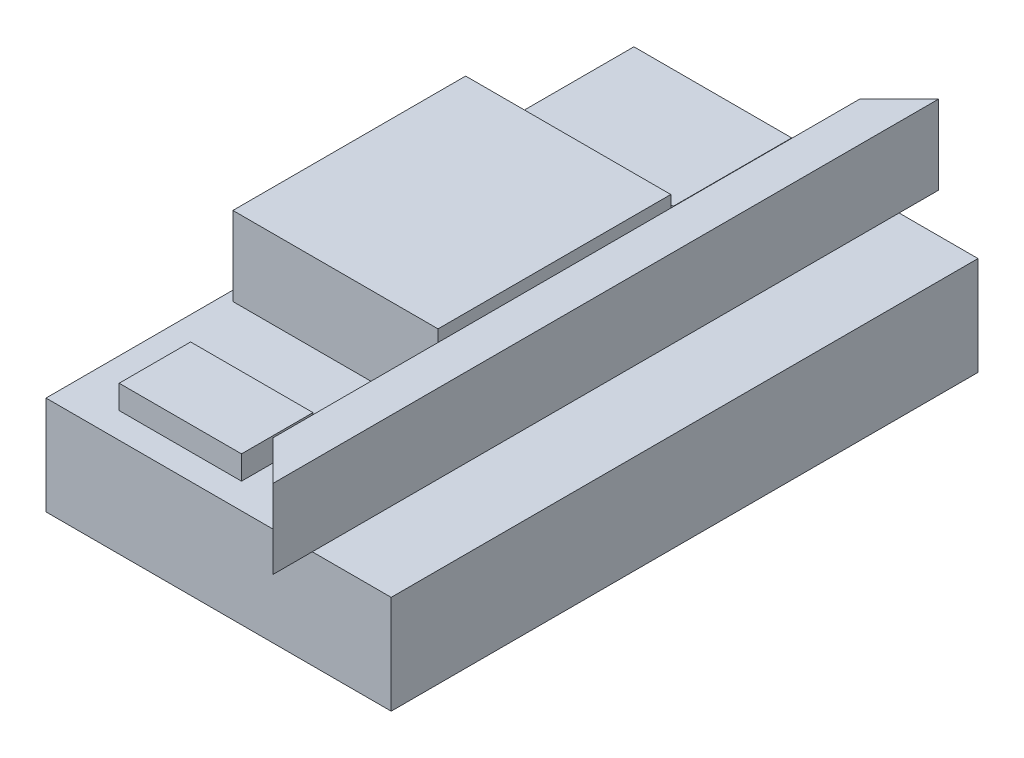
ISO-10303-21;
HEADER;
FILE_DESCRIPTION(('STEP AP214'),'2;1');
FILE_NAME('part.step','',(''),(''),'','','');
FILE_SCHEMA(('AUTOMOTIVE_DESIGN { 1 0 10303 214 1 1 1 1 }'));
ENDSEC;
DATA;
#1=APPLICATION_CONTEXT('core data for automotive mechanical design processes');
#2=APPLICATION_PROTOCOL_DEFINITION('international standard','automotive_design',2000,#1);
#3=PRODUCT_CONTEXT('',#1,'mechanical');
#4=PRODUCT('Part','Part','',(#3));
#5=PRODUCT_RELATED_PRODUCT_CATEGORY('part','',(#4));
#6=PRODUCT_DEFINITION_FORMATION('','',#4);
#7=PRODUCT_DEFINITION_CONTEXT('part definition',#1,'design');
#8=PRODUCT_DEFINITION('design','',#6,#7);
#9=PRODUCT_DEFINITION_SHAPE('','',#8);
#10=(LENGTH_UNIT() NAMED_UNIT(*) SI_UNIT(.MILLI.,.METRE.));
#11=(NAMED_UNIT(*) PLANE_ANGLE_UNIT() SI_UNIT($,.RADIAN.));
#12=(NAMED_UNIT(*) SI_UNIT($,.STERADIAN.) SOLID_ANGLE_UNIT());
#13=UNCERTAINTY_MEASURE_WITH_UNIT(LENGTH_MEASURE(1.E-05),#10,'distance_accuracy_value','');
#14=(GEOMETRIC_REPRESENTATION_CONTEXT(3) GLOBAL_UNCERTAINTY_ASSIGNED_CONTEXT((#13)) GLOBAL_UNIT_ASSIGNED_CONTEXT((#10,
#11,#12)) REPRESENTATION_CONTEXT('',''));
#15=CARTESIAN_POINT('',(0.,0.,0.));
#16=DIRECTION('',(0.,0.,1.));
#17=DIRECTION('',(1.,0.,0.));
#18=AXIS2_PLACEMENT_3D('',#15,#16,#17);
#19=CARTESIAN_POINT('',(0.,63.5,377.825));
#20=DIRECTION('',(0.,-1.,0.));
#21=DIRECTION('',(0.,0.,-1.));
#22=AXIS2_PLACEMENT_3D('',#19,#20,#21);
#23=PLANE('',#22);
#24=DIRECTION('',(0.,0.,-1.));
#25=VECTOR('',#24,1.);
#26=CARTESIAN_POINT('',(120.406671705079,63.5,94.2971975285047));
#27=LINE('',#26,#25);
#28=CARTESIAN_POINT('',(120.406671705079,63.5,94.2971975285047));
#29=VERTEX_POINT('',#28);
#30=CARTESIAN_POINT('',(120.406671705079,63.5,18.0971975285047));
#31=VERTEX_POINT('',#30);
#32=EDGE_CURVE('E305',#29,#31,#27,.T.);
#33=ORIENTED_EDGE('',*,*,#32,.F.);
#34=DIRECTION('',(1.,0.,0.));
#35=VECTOR('',#34,1.);
#36=CARTESIAN_POINT('',(120.406671705079,63.5,94.2971975285047));
#37=LINE('',#36,#35);
#38=CARTESIAN_POINT('',(18.8066717050788,63.5,94.2971975285047));
#39=VERTEX_POINT('',#38);
#40=EDGE_CURVE('E295',#39,#29,#37,.T.);
#41=ORIENTED_EDGE('',*,*,#40,.F.);
#42=DIRECTION('',(0.,0.,1.));
#43=VECTOR('',#42,1.);
#44=CARTESIAN_POINT('',(18.8066717050788,63.5,94.2971975285048));
#45=LINE('',#44,#43);
#46=CARTESIAN_POINT('',(18.8066717050788,63.5,18.0971975285048));
#47=VERTEX_POINT('',#46);
#48=EDGE_CURVE('E299',#47,#39,#45,.T.);
#49=ORIENTED_EDGE('',*,*,#48,.F.);
#50=DIRECTION('',(-1.,0.,0.));
#51=VECTOR('',#50,1.);
#52=CARTESIAN_POINT('',(120.406671705079,63.5,18.0971975285047));
#53=LINE('',#52,#51);
#54=EDGE_CURVE('E302',#31,#47,#53,.T.);
#55=ORIENTED_EDGE('',*,*,#54,.F.);
#56=EDGE_LOOP('',(#33,#41,#49,#55));
#57=FACE_BOUND('',#56,.T.);
#58=DIRECTION('',(0.,0.,1.));
#59=VECTOR('',#58,1.);
#60=CARTESIAN_POINT('',(146.05,63.5,403.225));
#61=LINE('',#60,#59);
#62=CARTESIAN_POINT('',(146.05,63.5,0.));
#63=VERTEX_POINT('',#62);
#64=CARTESIAN_POINT('',(146.05,63.5,377.825));
#65=VERTEX_POINT('',#64);
#66=EDGE_CURVE('E239',#63,#65,#61,.T.);
#67=ORIENTED_EDGE('',*,*,#66,.F.);
#68=DIRECTION('',(-1.,0.,0.));
#69=VECTOR('',#68,1.);
#70=CARTESIAN_POINT('',(0.,63.5,0.));
#71=LINE('',#70,#69);
#72=CARTESIAN_POINT('',(0.,63.5,0.));
#73=VERTEX_POINT('',#72);
#74=EDGE_CURVE('E226',#63,#73,#71,.T.);
#75=ORIENTED_EDGE('',*,*,#74,.T.);
#76=DIRECTION('',(0.,0.,-1.));
#77=VECTOR('',#76,1.);
#78=CARTESIAN_POINT('',(0.,63.5,377.825));
#79=LINE('',#78,#77);
#80=CARTESIAN_POINT('',(0.,63.5,377.825));
#81=VERTEX_POINT('',#80);
#82=EDGE_CURVE('E220',#81,#73,#79,.T.);
#83=ORIENTED_EDGE('',*,*,#82,.F.);
#84=DIRECTION('',(-1.,0.,0.));
#85=VECTOR('',#84,1.);
#86=CARTESIAN_POINT('',(0.,63.5,377.825));
#87=LINE('',#86,#85);
#88=EDGE_CURVE('E217',#65,#81,#87,.T.);
#89=ORIENTED_EDGE('',*,*,#88,.F.);
#90=EDGE_LOOP('',(#67,#75,#83,#89));
#91=FACE_BOUND('',#90,.T.);
#92=DIRECTION('',(0.,0.,-1.));
#93=VECTOR('',#92,1.);
#94=CARTESIAN_POINT('',(138.43,63.5,113.9825));
#95=LINE('',#94,#93);
#96=CARTESIAN_POINT('',(138.43,63.5,263.8425));
#97=VERTEX_POINT('',#96);
#98=CARTESIAN_POINT('',(138.43,63.5,113.9825));
#99=VERTEX_POINT('',#98);
#100=EDGE_CURVE('E272',#97,#99,#95,.T.);
#101=ORIENTED_EDGE('',*,*,#100,.F.);
#102=DIRECTION('',(1.,0.,0.));
#103=VECTOR('',#102,1.);
#104=CARTESIAN_POINT('',(138.43,63.5,263.8425));
#105=LINE('',#104,#103);
#106=CARTESIAN_POINT('',(6.34999999999995,63.5,263.8425));
#107=VERTEX_POINT('',#106);
#108=EDGE_CURVE('E262',#107,#97,#105,.T.);
#109=ORIENTED_EDGE('',*,*,#108,.F.);
#110=DIRECTION('',(0.,0.,1.));
#111=VECTOR('',#110,1.);
#112=CARTESIAN_POINT('',(6.34999999999995,63.5,113.9825));
#113=LINE('',#112,#111);
#114=CARTESIAN_POINT('',(6.34999999999995,63.5,113.9825));
#115=VERTEX_POINT('',#114);
#116=EDGE_CURVE('E266',#115,#107,#113,.T.);
#117=ORIENTED_EDGE('',*,*,#116,.F.);
#118=DIRECTION('',(-1.,0.,0.));
#119=VECTOR('',#118,1.);
#120=CARTESIAN_POINT('',(138.43,63.5,113.9825));
#121=LINE('',#120,#119);
#122=EDGE_CURVE('E269',#99,#115,#121,.T.);
#123=ORIENTED_EDGE('',*,*,#122,.F.);
#124=EDGE_LOOP('',(#101,#109,#117,#123));
#125=FACE_BOUND('',#124,.T.);
#126=DIRECTION('',(0.,0.,-1.));
#127=VECTOR('',#126,1.);
#128=CARTESIAN_POINT('',(109.303255926818,63.5,361.249309245466));
#129=LINE('',#128,#127);
#130=CARTESIAN_POINT('',(109.303255926818,63.5,361.249309245466));
#131=VERTEX_POINT('',#130);
#132=CARTESIAN_POINT('',(109.303255926818,63.5,315.233608424478));
#133=VERTEX_POINT('',#132);
#134=EDGE_CURVE('E335',#131,#133,#129,.T.);
#135=ORIENTED_EDGE('',*,*,#134,.F.);
#136=DIRECTION('',(1.,0.,0.));
#137=VECTOR('',#136,1.);
#138=CARTESIAN_POINT('',(109.303255926818,63.5,361.249309245466));
#139=LINE('',#138,#137);
#140=CARTESIAN_POINT('',(30.5246059731417,63.5,361.249309245466));
#141=VERTEX_POINT('',#140);
#142=EDGE_CURVE('E327',#141,#131,#139,.T.);
#143=ORIENTED_EDGE('',*,*,#142,.F.);
#144=DIRECTION('',(0.,0.,1.));
#145=VECTOR('',#144,1.);
#146=CARTESIAN_POINT('',(30.5246059731417,63.5,361.249309245466));
#147=LINE('',#146,#145);
#148=CARTESIAN_POINT('',(30.5246059731417,63.5,315.233608424478));
#149=VERTEX_POINT('',#148);
#150=EDGE_CURVE('E331',#149,#141,#147,.T.);
#151=ORIENTED_EDGE('',*,*,#150,.F.);
#152=DIRECTION('',(-1.,0.,0.));
#153=VECTOR('',#152,1.);
#154=CARTESIAN_POINT('',(109.303255926818,63.5,315.233608424478));
#155=LINE('',#154,#153);
#156=EDGE_CURVE('E56',#133,#149,#155,.T.);
#157=ORIENTED_EDGE('',*,*,#156,.F.);
#158=EDGE_LOOP('',(#135,#143,#151,#157));
#159=FACE_BOUND('',#158,.T.);
#160=ADVANCED_FACE('F33',(#57,#91,#125,#159),#23,.F.);
#161=DIRECTION('',(0.,0.,-1.));
#162=VECTOR('',#161,1.);
#163=CARTESIAN_POINT('',(171.45,63.5,403.225));
#164=LINE('',#163,#162);
#165=CARTESIAN_POINT('',(171.45,63.5,377.825));
#166=VERTEX_POINT('',#165);
#167=CARTESIAN_POINT('',(171.45,63.5,0.));
#168=VERTEX_POINT('',#167);
#169=EDGE_CURVE('E41',#166,#168,#164,.T.);
#170=ORIENTED_EDGE('',*,*,#169,.F.);
#171=CARTESIAN_POINT('',(222.25,63.5,377.825));
#172=VERTEX_POINT('',#171);
#173=EDGE_CURVE('E218',#172,#166,#87,.T.);
#174=ORIENTED_EDGE('',*,*,#173,.F.);
#175=DIRECTION('',(0.,0.,-1.));
#176=VECTOR('',#175,1.);
#177=CARTESIAN_POINT('',(222.25,63.5,377.825));
#178=LINE('',#177,#176);
#179=CARTESIAN_POINT('',(222.25,63.5,0.));
#180=VERTEX_POINT('',#179);
#181=EDGE_CURVE('E232',#172,#180,#178,.T.);
#182=ORIENTED_EDGE('',*,*,#181,.T.);
#183=EDGE_CURVE('E213',#180,#168,#71,.T.);
#184=ORIENTED_EDGE('',*,*,#183,.T.);
#185=EDGE_LOOP('',(#170,#174,#182,#184));
#186=FACE_BOUND('',#185,.T.);
#187=ADVANCED_FACE('F367',(#186),#23,.F.);
#188=CARTESIAN_POINT('',(0.,0.,377.825));
#189=DIRECTION('',(1.,0.,0.));
#190=DIRECTION('',(0.,0.,-1.));
#191=AXIS2_PLACEMENT_3D('',#188,#189,#190);
#192=PLANE('',#191);
#193=DIRECTION('',(0.,-1.,0.));
#194=VECTOR('',#193,1.);
#195=CARTESIAN_POINT('',(0.,0.,0.));
#196=LINE('',#195,#194);
#197=CARTESIAN_POINT('',(0.,0.,0.));
#198=VERTEX_POINT('',#197);
#199=EDGE_CURVE('E200',#73,#198,#196,.T.);
#200=ORIENTED_EDGE('',*,*,#199,.T.);
#201=DIRECTION('',(0.,0.,-1.));
#202=VECTOR('',#201,1.);
#203=CARTESIAN_POINT('',(0.,0.,377.825));
#204=LINE('',#203,#202);
#205=CARTESIAN_POINT('',(0.,0.,377.825));
#206=VERTEX_POINT('',#205);
#207=EDGE_CURVE('E237',#206,#198,#204,.T.);
#208=ORIENTED_EDGE('',*,*,#207,.F.);
#209=DIRECTION('',(0.,-1.,0.));
#210=VECTOR('',#209,1.);
#211=CARTESIAN_POINT('',(0.,0.,377.825));
#212=LINE('',#211,#210);
#213=EDGE_CURVE('E209',#81,#206,#212,.T.);
#214=ORIENTED_EDGE('',*,*,#213,.F.);
#215=ORIENTED_EDGE('',*,*,#82,.T.);
#216=EDGE_LOOP('',(#200,#208,#214,#215));
#217=FACE_BOUND('',#216,.T.);
#218=ADVANCED_FACE('F35',(#217),#192,.F.);
#219=CARTESIAN_POINT('',(0.,0.,377.825));
#220=DIRECTION('',(0.,1.,0.));
#221=DIRECTION('',(0.,0.,1.));
#222=AXIS2_PLACEMENT_3D('',#219,#220,#221);
#223=PLANE('',#222);
#224=DIRECTION('',(1.,0.,0.));
#225=VECTOR('',#224,1.);
#226=CARTESIAN_POINT('',(0.,0.,0.));
#227=LINE('',#226,#225);
#228=CARTESIAN_POINT('',(222.25,0.,0.));
#229=VERTEX_POINT('',#228);
#230=EDGE_CURVE('E204',#198,#229,#227,.T.);
#231=ORIENTED_EDGE('',*,*,#230,.T.);
#232=DIRECTION('',(0.,0.,-1.));
#233=VECTOR('',#232,1.);
#234=CARTESIAN_POINT('',(222.25,0.,377.825));
#235=LINE('',#234,#233);
#236=CARTESIAN_POINT('',(222.25,0.,377.825));
#237=VERTEX_POINT('',#236);
#238=EDGE_CURVE('E235',#237,#229,#235,.T.);
#239=ORIENTED_EDGE('',*,*,#238,.F.);
#240=DIRECTION('',(1.,0.,0.));
#241=VECTOR('',#240,1.);
#242=CARTESIAN_POINT('',(0.,0.,377.825));
#243=LINE('',#242,#241);
#244=EDGE_CURVE('E212',#206,#237,#243,.T.);
#245=ORIENTED_EDGE('',*,*,#244,.F.);
#246=ORIENTED_EDGE('',*,*,#207,.T.);
#247=EDGE_LOOP('',(#231,#239,#245,#246));
#248=FACE_BOUND('',#247,.T.);
#249=ADVANCED_FACE('F379',(#248),#223,.F.);
#250=CARTESIAN_POINT('',(222.25,0.,377.825));
#251=DIRECTION('',(-1.,0.,0.));
#252=DIRECTION('',(0.,0.,1.));
#253=AXIS2_PLACEMENT_3D('',#250,#251,#252);
#254=PLANE('',#253);
#255=DIRECTION('',(0.,1.,0.));
#256=VECTOR('',#255,1.);
#257=CARTESIAN_POINT('',(222.25,0.,0.));
#258=LINE('',#257,#256);
#259=EDGE_CURVE('E224',#229,#180,#258,.T.);
#260=ORIENTED_EDGE('',*,*,#259,.T.);
#261=ORIENTED_EDGE('',*,*,#181,.F.);
#262=DIRECTION('',(0.,1.,0.));
#263=VECTOR('',#262,1.);
#264=CARTESIAN_POINT('',(222.25,0.,377.825));
#265=LINE('',#264,#263);
#266=EDGE_CURVE('E215',#237,#172,#265,.T.);
#267=ORIENTED_EDGE('',*,*,#266,.F.);
#268=ORIENTED_EDGE('',*,*,#238,.T.);
#269=EDGE_LOOP('',(#260,#261,#267,#268));
#270=FACE_BOUND('',#269,.T.);
#271=ADVANCED_FACE('F385',(#270),#254,.F.);
#272=CARTESIAN_POINT('',(0.,0.,377.825));
#273=DIRECTION('',(0.,0.,-1.));
#274=DIRECTION('',(-1.,0.,0.));
#275=AXIS2_PLACEMENT_3D('',#272,#273,#274);
#276=PLANE('',#275);
#277=EDGE_CURVE('E221',#166,#65,#87,.T.);
#278=ORIENTED_EDGE('',*,*,#277,.T.);
#279=ORIENTED_EDGE('',*,*,#88,.T.);
#280=ORIENTED_EDGE('',*,*,#213,.T.);
#281=ORIENTED_EDGE('',*,*,#244,.T.);
#282=ORIENTED_EDGE('',*,*,#266,.T.);
#283=ORIENTED_EDGE('',*,*,#173,.T.);
#284=EDGE_LOOP('',(#278,#279,#280,#281,#282,#283));
#285=FACE_BOUND('',#284,.T.);
#286=ADVANCED_FACE('F371',(#285),#276,.F.);
#287=CARTESIAN_POINT('',(0.,0.,0.));
#288=DIRECTION('',(0.,0.,-1.));
#289=DIRECTION('',(-1.,0.,0.));
#290=AXIS2_PLACEMENT_3D('',#287,#288,#289);
#291=PLANE('',#290);
#292=ORIENTED_EDGE('',*,*,#74,.F.);
#293=EDGE_CURVE('E229',#168,#63,#71,.T.);
#294=ORIENTED_EDGE('',*,*,#293,.F.);
#295=ORIENTED_EDGE('',*,*,#183,.F.);
#296=ORIENTED_EDGE('',*,*,#259,.F.);
#297=ORIENTED_EDGE('',*,*,#230,.F.);
#298=ORIENTED_EDGE('',*,*,#199,.F.);
#299=EDGE_LOOP('',(#292,#294,#295,#296,#297,#298));
#300=FACE_BOUND('',#299,.T.);
#301=ADVANCED_FACE('F360',(#300),#291,.T.);
#302=CARTESIAN_POINT('',(0.,63.5,0.));
#303=DIRECTION('',(0.,1.,0.));
#304=DIRECTION('',(0.,0.,1.));
#305=AXIS2_PLACEMENT_3D('',#302,#303,#304);
#306=PLANE('',#305);
#307=ORIENTED_EDGE('',*,*,#293,.T.);
#308=DIRECTION('',(0.707106781186548,0.,-0.707106781186547));
#309=VECTOR('',#308,1.);
#310=CARTESIAN_POINT('',(73.025,63.5,73.025));
#311=LINE('',#310,#309);
#312=CARTESIAN_POINT('',(171.45,63.5,-25.4));
#313=VERTEX_POINT('',#312);
#314=EDGE_CURVE('E338',#63,#313,#311,.T.);
#315=ORIENTED_EDGE('',*,*,#314,.T.);
#316=EDGE_CURVE('E199',#168,#313,#164,.T.);
#317=ORIENTED_EDGE('',*,*,#316,.F.);
#318=EDGE_LOOP('',(#307,#315,#317));
#319=FACE_BOUND('',#318,.T.);
#320=ADVANCED_FACE('F363',(#319),#306,.F.);
#321=CARTESIAN_POINT('',(171.45,114.3,403.225));
#322=DIRECTION('',(-1.,0.,0.));
#323=DIRECTION('',(0.,0.,1.));
#324=AXIS2_PLACEMENT_3D('',#321,#322,#323);
#325=PLANE('',#324);
#326=CARTESIAN_POINT('',(171.45,63.5,403.225));
#327=VERTEX_POINT('',#326);
#328=EDGE_CURVE('E192',#327,#166,#164,.T.);
#329=ORIENTED_EDGE('',*,*,#328,.T.);
#330=ORIENTED_EDGE('',*,*,#169,.T.);
#331=ORIENTED_EDGE('',*,*,#316,.T.);
#332=DIRECTION('',(0.,-1.,0.));
#333=VECTOR('',#332,1.);
#334=CARTESIAN_POINT('',(171.45,114.3,-25.4));
#335=LINE('',#334,#333);
#336=CARTESIAN_POINT('',(171.45,114.3,-25.4));
#337=VERTEX_POINT('',#336);
#338=EDGE_CURVE('E177',#337,#313,#335,.T.);
#339=ORIENTED_EDGE('',*,*,#338,.F.);
#340=DIRECTION('',(0.,0.,-1.));
#341=VECTOR('',#340,1.);
#342=CARTESIAN_POINT('',(171.45,114.3,403.225));
#343=LINE('',#342,#341);
#344=CARTESIAN_POINT('',(171.45,114.3,403.225));
#345=VERTEX_POINT('',#344);
#346=EDGE_CURVE('E186',#345,#337,#343,.T.);
#347=ORIENTED_EDGE('',*,*,#346,.F.);
#348=DIRECTION('',(0.,-1.,0.));
#349=VECTOR('',#348,1.);
#350=CARTESIAN_POINT('',(171.45,114.3,403.225));
#351=LINE('',#350,#349);
#352=EDGE_CURVE('E201',#345,#327,#351,.T.);
#353=ORIENTED_EDGE('',*,*,#352,.T.);
#354=EDGE_LOOP('',(#329,#330,#331,#339,#347,#353));
#355=FACE_BOUND('',#354,.T.);
#356=ADVANCED_FACE('F196',(#355),#325,.F.);
#357=CARTESIAN_POINT('',(146.05,114.3,403.225));
#358=DIRECTION('',(1.,0.,0.));
#359=DIRECTION('',(0.,0.,-1.));
#360=AXIS2_PLACEMENT_3D('',#357,#358,#359);
#361=PLANE('',#360);
#362=DIRECTION('',(0.,0.,1.));
#363=VECTOR('',#362,1.);
#364=CARTESIAN_POINT('',(146.05,114.3,403.225));
#365=LINE('',#364,#363);
#366=CARTESIAN_POINT('',(146.05,114.3,0.));
#367=VERTEX_POINT('',#366);
#368=CARTESIAN_POINT('',(146.05,114.3,377.825));
#369=VERTEX_POINT('',#368);
#370=EDGE_CURVE('E191',#367,#369,#365,.T.);
#371=ORIENTED_EDGE('',*,*,#370,.F.);
#372=DIRECTION('',(0.,1.,0.));
#373=VECTOR('',#372,1.);
#374=CARTESIAN_POINT('',(146.05,-12.7,0.));
#375=LINE('',#374,#373);
#376=EDGE_CURVE('E48',#63,#367,#375,.T.);
#377=ORIENTED_EDGE('',*,*,#376,.F.);
#378=ORIENTED_EDGE('',*,*,#66,.T.);
#379=DIRECTION('',(0.,1.,0.));
#380=VECTOR('',#379,1.);
#381=CARTESIAN_POINT('',(146.05,-12.7,377.825));
#382=LINE('',#381,#380);
#383=EDGE_CURVE('E182',#65,#369,#382,.T.);
#384=ORIENTED_EDGE('',*,*,#383,.T.);
#385=EDGE_LOOP('',(#371,#377,#378,#384));
#386=FACE_BOUND('',#385,.T.);
#387=ADVANCED_FACE('F351',(#386),#361,.F.);
#388=CARTESIAN_POINT('',(0.,114.3,0.));
#389=DIRECTION('',(0.,1.,0.));
#390=DIRECTION('',(0.,0.,1.));
#391=AXIS2_PLACEMENT_3D('',#388,#389,#390);
#392=PLANE('',#391);
#393=DIRECTION('',(0.707106781186548,0.,-0.707106781186547));
#394=VECTOR('',#393,1.);
#395=CARTESIAN_POINT('',(171.45,114.3,-25.4));
#396=LINE('',#395,#394);
#397=EDGE_CURVE('E173',#367,#337,#396,.T.);
#398=ORIENTED_EDGE('',*,*,#397,.F.);
#399=ORIENTED_EDGE('',*,*,#370,.T.);
#400=DIRECTION('',(-0.707106781186548,0.,-0.707106781186547));
#401=VECTOR('',#400,1.);
#402=CARTESIAN_POINT('',(171.45,114.3,403.225));
#403=LINE('',#402,#401);
#404=EDGE_CURVE('E188',#345,#369,#403,.T.);
#405=ORIENTED_EDGE('',*,*,#404,.F.);
#406=ORIENTED_EDGE('',*,*,#346,.T.);
#407=EDGE_LOOP('',(#398,#399,#405,#406));
#408=FACE_BOUND('',#407,.T.);
#409=ADVANCED_FACE('F187',(#408),#392,.T.);
#410=ORIENTED_EDGE('',*,*,#328,.F.);
#411=DIRECTION('',(-0.707106781186548,0.,-0.707106781186547));
#412=VECTOR('',#411,1.);
#413=CARTESIAN_POINT('',(-115.8875,63.5,115.8875));
#414=LINE('',#413,#412);
#415=EDGE_CURVE('E11',#327,#65,#414,.T.);
#416=ORIENTED_EDGE('',*,*,#415,.T.);
#417=ORIENTED_EDGE('',*,*,#277,.F.);
#418=EDGE_LOOP('',(#410,#416,#417));
#419=FACE_BOUND('',#418,.T.);
#420=ADVANCED_FACE('F375',(#419),#306,.F.);
#421=CARTESIAN_POINT('',(138.43,114.3,113.9825));
#422=DIRECTION('',(-1.,0.,0.));
#423=DIRECTION('',(0.,0.,1.));
#424=AXIS2_PLACEMENT_3D('',#421,#422,#423);
#425=PLANE('',#424);
#426=ORIENTED_EDGE('',*,*,#100,.T.);
#427=DIRECTION('',(0.,-1.,0.));
#428=VECTOR('',#427,1.);
#429=CARTESIAN_POINT('',(138.43,114.3,113.9825));
#430=LINE('',#429,#428);
#431=CARTESIAN_POINT('',(138.43,114.3,113.9825));
#432=VERTEX_POINT('',#431);
#433=EDGE_CURVE('E249',#432,#99,#430,.T.);
#434=ORIENTED_EDGE('',*,*,#433,.F.);
#435=DIRECTION('',(0.,0.,-1.));
#436=VECTOR('',#435,1.);
#437=CARTESIAN_POINT('',(138.43,114.3,113.9825));
#438=LINE('',#437,#436);
#439=CARTESIAN_POINT('',(138.43,114.3,263.8425));
#440=VERTEX_POINT('',#439);
#441=EDGE_CURVE('E265',#440,#432,#438,.T.);
#442=ORIENTED_EDGE('',*,*,#441,.F.);
#443=DIRECTION('',(0.,-1.,0.));
#444=VECTOR('',#443,1.);
#445=CARTESIAN_POINT('',(138.43,114.3,263.8425));
#446=LINE('',#445,#444);
#447=EDGE_CURVE('E258',#440,#97,#446,.T.);
#448=ORIENTED_EDGE('',*,*,#447,.T.);
#449=EDGE_LOOP('',(#426,#434,#442,#448));
#450=FACE_BOUND('',#449,.T.);
#451=ADVANCED_FACE('F412',(#450),#425,.F.);
#452=CARTESIAN_POINT('',(138.43,114.3,113.9825));
#453=DIRECTION('',(0.,0.,1.));
#454=DIRECTION('',(1.,0.,0.));
#455=AXIS2_PLACEMENT_3D('',#452,#453,#454);
#456=PLANE('',#455);
#457=ORIENTED_EDGE('',*,*,#122,.T.);
#458=DIRECTION('',(0.,-1.,0.));
#459=VECTOR('',#458,1.);
#460=CARTESIAN_POINT('',(6.34999999999995,114.3,113.9825));
#461=LINE('',#460,#459);
#462=CARTESIAN_POINT('',(6.34999999999995,114.3,113.9825));
#463=VERTEX_POINT('',#462);
#464=EDGE_CURVE('E252',#463,#115,#461,.T.);
#465=ORIENTED_EDGE('',*,*,#464,.F.);
#466=DIRECTION('',(-1.,0.,0.));
#467=VECTOR('',#466,1.);
#468=CARTESIAN_POINT('',(138.43,114.3,113.9825));
#469=LINE('',#468,#467);
#470=EDGE_CURVE('E279',#432,#463,#469,.T.);
#471=ORIENTED_EDGE('',*,*,#470,.F.);
#472=ORIENTED_EDGE('',*,*,#433,.T.);
#473=EDGE_LOOP('',(#457,#465,#471,#472));
#474=FACE_BOUND('',#473,.T.);
#475=ADVANCED_FACE('F417',(#474),#456,.F.);
#476=CARTESIAN_POINT('',(6.34999999999995,114.3,113.9825));
#477=DIRECTION('',(1.,0.,0.));
#478=DIRECTION('',(0.,0.,-1.));
#479=AXIS2_PLACEMENT_3D('',#476,#477,#478);
#480=PLANE('',#479);
#481=ORIENTED_EDGE('',*,*,#116,.T.);
#482=DIRECTION('',(0.,-1.,0.));
#483=VECTOR('',#482,1.);
#484=CARTESIAN_POINT('',(6.34999999999995,114.3,263.8425));
#485=LINE('',#484,#483);
#486=CARTESIAN_POINT('',(6.34999999999995,114.3,263.8425));
#487=VERTEX_POINT('',#486);
#488=EDGE_CURVE('E255',#487,#107,#485,.T.);
#489=ORIENTED_EDGE('',*,*,#488,.F.);
#490=DIRECTION('',(0.,0.,1.));
#491=VECTOR('',#490,1.);
#492=CARTESIAN_POINT('',(6.34999999999995,114.3,113.9825));
#493=LINE('',#492,#491);
#494=EDGE_CURVE('E277',#463,#487,#493,.T.);
#495=ORIENTED_EDGE('',*,*,#494,.F.);
#496=ORIENTED_EDGE('',*,*,#464,.T.);
#497=EDGE_LOOP('',(#481,#489,#495,#496));
#498=FACE_BOUND('',#497,.T.);
#499=ADVANCED_FACE('F421',(#498),#480,.F.);
#500=CARTESIAN_POINT('',(138.43,114.3,263.8425));
#501=DIRECTION('',(0.,0.,-1.));
#502=DIRECTION('',(-1.,0.,0.));
#503=AXIS2_PLACEMENT_3D('',#500,#501,#502);
#504=PLANE('',#503);
#505=ORIENTED_EDGE('',*,*,#108,.T.);
#506=ORIENTED_EDGE('',*,*,#447,.F.);
#507=DIRECTION('',(1.,0.,0.));
#508=VECTOR('',#507,1.);
#509=CARTESIAN_POINT('',(138.43,114.3,263.8425));
#510=LINE('',#509,#508);
#511=EDGE_CURVE('E261',#487,#440,#510,.T.);
#512=ORIENTED_EDGE('',*,*,#511,.F.);
#513=ORIENTED_EDGE('',*,*,#488,.T.);
#514=EDGE_LOOP('',(#505,#506,#512,#513));
#515=FACE_BOUND('',#514,.T.);
#516=ADVANCED_FACE('F425',(#515),#504,.F.);
#517=CARTESIAN_POINT('',(0.,114.3,0.));
#518=DIRECTION('',(0.,-1.,0.));
#519=DIRECTION('',(0.,0.,-1.));
#520=AXIS2_PLACEMENT_3D('',#517,#518,#519);
#521=PLANE('',#520);
#522=ORIENTED_EDGE('',*,*,#441,.T.);
#523=ORIENTED_EDGE('',*,*,#470,.T.);
#524=ORIENTED_EDGE('',*,*,#494,.T.);
#525=ORIENTED_EDGE('',*,*,#511,.T.);
#526=EDGE_LOOP('',(#522,#523,#524,#525));
#527=FACE_BOUND('',#526,.T.);
#528=ADVANCED_FACE('F429',(#527),#521,.F.);
#529=CARTESIAN_POINT('',(120.406671705079,88.9,94.2971975285047));
#530=DIRECTION('',(-1.,0.,0.));
#531=DIRECTION('',(0.,0.,1.));
#532=AXIS2_PLACEMENT_3D('',#529,#530,#531);
#533=PLANE('',#532);
#534=ORIENTED_EDGE('',*,*,#32,.T.);
#535=DIRECTION('',(0.,-1.,0.));
#536=VECTOR('',#535,1.);
#537=CARTESIAN_POINT('',(120.406671705079,88.9,18.0971975285047));
#538=LINE('',#537,#536);
#539=CARTESIAN_POINT('',(120.406671705079,88.9,18.0971975285047));
#540=VERTEX_POINT('',#539);
#541=EDGE_CURVE('E275',#540,#31,#538,.T.);
#542=ORIENTED_EDGE('',*,*,#541,.F.);
#543=DIRECTION('',(0.,0.,-1.));
#544=VECTOR('',#543,1.);
#545=CARTESIAN_POINT('',(120.406671705079,88.9,94.2971975285047));
#546=LINE('',#545,#544);
#547=CARTESIAN_POINT('',(120.406671705079,88.9,94.2971975285047));
#548=VERTEX_POINT('',#547);
#549=EDGE_CURVE('E298',#548,#540,#546,.T.);
#550=ORIENTED_EDGE('',*,*,#549,.F.);
#551=DIRECTION('',(0.,-1.,0.));
#552=VECTOR('',#551,1.);
#553=CARTESIAN_POINT('',(120.406671705079,88.9,94.2971975285047));
#554=LINE('',#553,#552);
#555=EDGE_CURVE('E291',#548,#29,#554,.T.);
#556=ORIENTED_EDGE('',*,*,#555,.T.);
#557=EDGE_LOOP('',(#534,#542,#550,#556));
#558=FACE_BOUND('',#557,.T.);
#559=ADVANCED_FACE('F433',(#558),#533,.F.);
#560=CARTESIAN_POINT('',(120.406671705079,88.9,18.0971975285047));
#561=DIRECTION('',(0.,0.,1.));
#562=DIRECTION('',(1.,0.,0.));
#563=AXIS2_PLACEMENT_3D('',#560,#561,#562);
#564=PLANE('',#563);
#565=ORIENTED_EDGE('',*,*,#54,.T.);
#566=DIRECTION('',(0.,-1.,0.));
#567=VECTOR('',#566,1.);
#568=CARTESIAN_POINT('',(18.8066717050788,88.9,18.0971975285048));
#569=LINE('',#568,#567);
#570=CARTESIAN_POINT('',(18.8066717050788,88.9,18.0971975285048));
#571=VERTEX_POINT('',#570);
#572=EDGE_CURVE('E285',#571,#47,#569,.T.);
#573=ORIENTED_EDGE('',*,*,#572,.F.);
#574=DIRECTION('',(-1.,0.,0.));
#575=VECTOR('',#574,1.);
#576=CARTESIAN_POINT('',(120.406671705079,88.9,18.0971975285047));
#577=LINE('',#576,#575);
#578=EDGE_CURVE('E312',#540,#571,#577,.T.);
#579=ORIENTED_EDGE('',*,*,#578,.F.);
#580=ORIENTED_EDGE('',*,*,#541,.T.);
#581=EDGE_LOOP('',(#565,#573,#579,#580));
#582=FACE_BOUND('',#581,.T.);
#583=ADVANCED_FACE('F437',(#582),#564,.F.);
#584=CARTESIAN_POINT('',(18.8066717050788,88.9,94.2971975285048));
#585=DIRECTION('',(1.,0.,0.));
#586=DIRECTION('',(0.,0.,-1.));
#587=AXIS2_PLACEMENT_3D('',#584,#585,#586);
#588=PLANE('',#587);
#589=ORIENTED_EDGE('',*,*,#48,.T.);
#590=DIRECTION('',(0.,-1.,0.));
#591=VECTOR('',#590,1.);
#592=CARTESIAN_POINT('',(18.8066717050788,88.9,94.2971975285048));
#593=LINE('',#592,#591);
#594=CARTESIAN_POINT('',(18.8066717050788,88.9,94.2971975285048));
#595=VERTEX_POINT('',#594);
#596=EDGE_CURVE('E288',#595,#39,#593,.T.);
#597=ORIENTED_EDGE('',*,*,#596,.F.);
#598=DIRECTION('',(0.,0.,1.));
#599=VECTOR('',#598,1.);
#600=CARTESIAN_POINT('',(18.8066717050788,88.9,94.2971975285048));
#601=LINE('',#600,#599);
#602=EDGE_CURVE('E310',#571,#595,#601,.T.);
#603=ORIENTED_EDGE('',*,*,#602,.F.);
#604=ORIENTED_EDGE('',*,*,#572,.T.);
#605=EDGE_LOOP('',(#589,#597,#603,#604));
#606=FACE_BOUND('',#605,.T.);
#607=ADVANCED_FACE('F441',(#606),#588,.F.);
#608=CARTESIAN_POINT('',(120.406671705079,88.9,94.2971975285047));
#609=DIRECTION('',(0.,0.,-1.));
#610=DIRECTION('',(-1.,0.,0.));
#611=AXIS2_PLACEMENT_3D('',#608,#609,#610);
#612=PLANE('',#611);
#613=ORIENTED_EDGE('',*,*,#40,.T.);
#614=ORIENTED_EDGE('',*,*,#555,.F.);
#615=DIRECTION('',(1.,0.,0.));
#616=VECTOR('',#615,1.);
#617=CARTESIAN_POINT('',(120.406671705079,88.9,94.2971975285047));
#618=LINE('',#617,#616);
#619=EDGE_CURVE('E294',#595,#548,#618,.T.);
#620=ORIENTED_EDGE('',*,*,#619,.F.);
#621=ORIENTED_EDGE('',*,*,#596,.T.);
#622=EDGE_LOOP('',(#613,#614,#620,#621));
#623=FACE_BOUND('',#622,.T.);
#624=ADVANCED_FACE('F445',(#623),#612,.F.);
#625=CARTESIAN_POINT('',(0.,88.9,0.));
#626=DIRECTION('',(0.,1.,0.));
#627=DIRECTION('',(0.,0.,1.));
#628=AXIS2_PLACEMENT_3D('',#625,#626,#627);
#629=PLANE('',#628);
#630=ORIENTED_EDGE('',*,*,#549,.T.);
#631=ORIENTED_EDGE('',*,*,#578,.T.);
#632=ORIENTED_EDGE('',*,*,#602,.T.);
#633=ORIENTED_EDGE('',*,*,#619,.T.);
#634=EDGE_LOOP('',(#630,#631,#632,#633));
#635=FACE_BOUND('',#634,.T.);
#636=ADVANCED_FACE('F449',(#635),#629,.T.);
#637=CARTESIAN_POINT('',(109.303255926818,78.74,361.249309245466));
#638=DIRECTION('',(-1.,0.,0.));
#639=DIRECTION('',(0.,0.,1.));
#640=AXIS2_PLACEMENT_3D('',#637,#638,#639);
#641=PLANE('',#640);
#642=ORIENTED_EDGE('',*,*,#134,.T.);
#643=DIRECTION('',(0.,-1.,0.));
#644=VECTOR('',#643,1.);
#645=CARTESIAN_POINT('',(109.303255926818,78.74,315.233608424478));
#646=LINE('',#645,#644);
#647=CARTESIAN_POINT('',(109.303255926818,78.74,315.233608424478));
#648=VERTEX_POINT('',#647);
#649=EDGE_CURVE('E308',#648,#133,#646,.T.);
#650=ORIENTED_EDGE('',*,*,#649,.F.);
#651=DIRECTION('',(0.,0.,-1.));
#652=VECTOR('',#651,1.);
#653=CARTESIAN_POINT('',(109.303255926818,78.74,361.249309245466));
#654=LINE('',#653,#652);
#655=CARTESIAN_POINT('',(109.303255926818,78.74,361.249309245466));
#656=VERTEX_POINT('',#655);
#657=EDGE_CURVE('E330',#656,#648,#654,.T.);
#658=ORIENTED_EDGE('',*,*,#657,.F.);
#659=DIRECTION('',(0.,-1.,0.));
#660=VECTOR('',#659,1.);
#661=CARTESIAN_POINT('',(109.303255926818,78.74,361.249309245466));
#662=LINE('',#661,#660);
#663=EDGE_CURVE('E323',#656,#131,#662,.T.);
#664=ORIENTED_EDGE('',*,*,#663,.T.);
#665=EDGE_LOOP('',(#642,#650,#658,#664));
#666=FACE_BOUND('',#665,.T.);
#667=ADVANCED_FACE('F453',(#666),#641,.F.);
#668=CARTESIAN_POINT('',(109.303255926818,78.74,315.233608424478));
#669=DIRECTION('',(0.,0.,1.));
#670=DIRECTION('',(1.,0.,0.));
#671=AXIS2_PLACEMENT_3D('',#668,#669,#670);
#672=PLANE('',#671);
#673=ORIENTED_EDGE('',*,*,#156,.T.);
#674=DIRECTION('',(0.,-1.,0.));
#675=VECTOR('',#674,1.);
#676=CARTESIAN_POINT('',(30.5246059731417,78.74,315.233608424478));
#677=LINE('',#676,#675);
#678=CARTESIAN_POINT('',(30.5246059731417,78.74,315.233608424478));
#679=VERTEX_POINT('',#678);
#680=EDGE_CURVE('E317',#679,#149,#677,.T.);
#681=ORIENTED_EDGE('',*,*,#680,.F.);
#682=DIRECTION('',(-1.,0.,0.));
#683=VECTOR('',#682,1.);
#684=CARTESIAN_POINT('',(109.303255926818,78.74,315.233608424478));
#685=LINE('',#684,#683);
#686=EDGE_CURVE('E342',#648,#679,#685,.T.);
#687=ORIENTED_EDGE('',*,*,#686,.F.);
#688=ORIENTED_EDGE('',*,*,#649,.T.);
#689=EDGE_LOOP('',(#673,#681,#687,#688));
#690=FACE_BOUND('',#689,.T.);
#691=ADVANCED_FACE('F457',(#690),#672,.F.);
#692=CARTESIAN_POINT('',(30.5246059731417,78.74,361.249309245466));
#693=DIRECTION('',(1.,0.,0.));
#694=DIRECTION('',(0.,0.,-1.));
#695=AXIS2_PLACEMENT_3D('',#692,#693,#694);
#696=PLANE('',#695);
#697=ORIENTED_EDGE('',*,*,#150,.T.);
#698=DIRECTION('',(0.,-1.,0.));
#699=VECTOR('',#698,1.);
#700=CARTESIAN_POINT('',(30.5246059731417,78.74,361.249309245466));
#701=LINE('',#700,#699);
#702=CARTESIAN_POINT('',(30.5246059731417,78.74,361.249309245466));
#703=VERTEX_POINT('',#702);
#704=EDGE_CURVE('E320',#703,#141,#701,.T.);
#705=ORIENTED_EDGE('',*,*,#704,.F.);
#706=DIRECTION('',(0.,0.,1.));
#707=VECTOR('',#706,1.);
#708=CARTESIAN_POINT('',(30.5246059731417,78.74,361.249309245466));
#709=LINE('',#708,#707);
#710=EDGE_CURVE('E340',#679,#703,#709,.T.);
#711=ORIENTED_EDGE('',*,*,#710,.F.);
#712=ORIENTED_EDGE('',*,*,#680,.T.);
#713=EDGE_LOOP('',(#697,#705,#711,#712));
#714=FACE_BOUND('',#713,.T.);
#715=ADVANCED_FACE('F461',(#714),#696,.F.);
#716=CARTESIAN_POINT('',(109.303255926818,78.74,361.249309245466));
#717=DIRECTION('',(0.,0.,-1.));
#718=DIRECTION('',(-1.,0.,0.));
#719=AXIS2_PLACEMENT_3D('',#716,#717,#718);
#720=PLANE('',#719);
#721=ORIENTED_EDGE('',*,*,#142,.T.);
#722=ORIENTED_EDGE('',*,*,#663,.F.);
#723=DIRECTION('',(1.,0.,0.));
#724=VECTOR('',#723,1.);
#725=CARTESIAN_POINT('',(109.303255926818,78.74,361.249309245466));
#726=LINE('',#725,#724);
#727=EDGE_CURVE('E326',#703,#656,#726,.T.);
#728=ORIENTED_EDGE('',*,*,#727,.F.);
#729=ORIENTED_EDGE('',*,*,#704,.T.);
#730=EDGE_LOOP('',(#721,#722,#728,#729));
#731=FACE_BOUND('',#730,.T.);
#732=ADVANCED_FACE('F465',(#731),#720,.F.);
#733=CARTESIAN_POINT('',(0.,78.74,0.));
#734=DIRECTION('',(0.,1.,0.));
#735=DIRECTION('',(0.,0.,1.));
#736=AXIS2_PLACEMENT_3D('',#733,#734,#735);
#737=PLANE('',#736);
#738=ORIENTED_EDGE('',*,*,#657,.T.);
#739=ORIENTED_EDGE('',*,*,#686,.T.);
#740=ORIENTED_EDGE('',*,*,#710,.T.);
#741=ORIENTED_EDGE('',*,*,#727,.T.);
#742=EDGE_LOOP('',(#738,#739,#740,#741));
#743=FACE_BOUND('',#742,.T.);
#744=ADVANCED_FACE('F469',(#743),#737,.T.);
#745=CARTESIAN_POINT('',(171.45,-12.7,403.225));
#746=DIRECTION('',(0.707106781186547,0.,-0.707106781186548));
#747=DIRECTION('',(-0.707106781186548,0.,-0.707106781186547));
#748=AXIS2_PLACEMENT_3D('',#745,#746,#747);
#749=PLANE('',#748);
#750=ORIENTED_EDGE('',*,*,#352,.F.);
#751=ORIENTED_EDGE('',*,*,#404,.T.);
#752=ORIENTED_EDGE('',*,*,#383,.F.);
#753=ORIENTED_EDGE('',*,*,#415,.F.);
#754=EDGE_LOOP('',(#750,#751,#752,#753));
#755=FACE_BOUND('',#754,.T.);
#756=ADVANCED_FACE('F350',(#755),#749,.F.);
#757=CARTESIAN_POINT('',(171.45,-12.7,-25.4));
#758=DIRECTION('',(0.707106781186547,0.,0.707106781186548));
#759=DIRECTION('',(0.707106781186548,0.,-0.707106781186547));
#760=AXIS2_PLACEMENT_3D('',#757,#758,#759);
#761=PLANE('',#760);
#762=ORIENTED_EDGE('',*,*,#376,.T.);
#763=ORIENTED_EDGE('',*,*,#397,.T.);
#764=ORIENTED_EDGE('',*,*,#338,.T.);
#765=ORIENTED_EDGE('',*,*,#314,.F.);
#766=EDGE_LOOP('',(#762,#763,#764,#765));
#767=FACE_BOUND('',#766,.T.);
#768=ADVANCED_FACE('F175',(#767),#761,.F.);
#769=CLOSED_SHELL('',(#160,#187,#218,#249,#271,#286,#301,#320,#356,#387,#409,#420,#451,#475,
#499,#516,#528,#559,#583,#607,#624,#636,#667,#691,#715,#732,#744,#756,#768));
#770=MANIFOLD_SOLID_BREP('B2',#769);
#771=ADVANCED_BREP_SHAPE_REPRESENTATION('',(#18,#770),#14);
#772=SHAPE_DEFINITION_REPRESENTATION(#9,#771);
ENDSEC;
END-ISO-10303-21;
